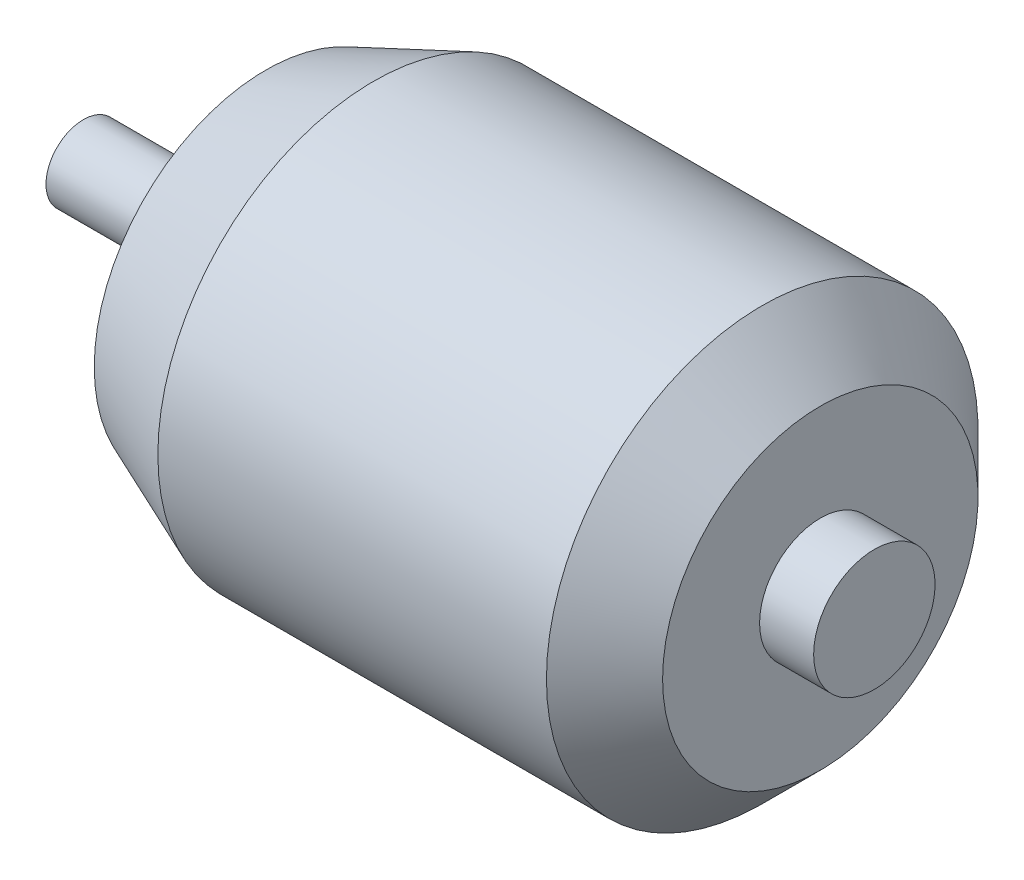
ISO-10303-21;
HEADER;
FILE_DESCRIPTION(('STEP AP214'),'2;1');
FILE_NAME('part.step','',(''),(''),'','','');
FILE_SCHEMA(('AUTOMOTIVE_DESIGN { 1 0 10303 214 1 1 1 1 }'));
ENDSEC;
DATA;
#1=APPLICATION_CONTEXT('core data for automotive mechanical design processes');
#2=APPLICATION_PROTOCOL_DEFINITION('international standard','automotive_design',2000,#1);
#3=PRODUCT_CONTEXT('',#1,'mechanical');
#4=PRODUCT('Part','Part','',(#3));
#5=PRODUCT_RELATED_PRODUCT_CATEGORY('part','',(#4));
#6=PRODUCT_DEFINITION_FORMATION('','',#4);
#7=PRODUCT_DEFINITION_CONTEXT('part definition',#1,'design');
#8=PRODUCT_DEFINITION('design','',#6,#7);
#9=PRODUCT_DEFINITION_SHAPE('','',#8);
#10=(LENGTH_UNIT() NAMED_UNIT(*) SI_UNIT(.MILLI.,.METRE.));
#11=(NAMED_UNIT(*) PLANE_ANGLE_UNIT() SI_UNIT($,.RADIAN.));
#12=(NAMED_UNIT(*) SI_UNIT($,.STERADIAN.) SOLID_ANGLE_UNIT());
#13=UNCERTAINTY_MEASURE_WITH_UNIT(LENGTH_MEASURE(1.E-05),#10,'distance_accuracy_value','');
#14=(GEOMETRIC_REPRESENTATION_CONTEXT(3) GLOBAL_UNCERTAINTY_ASSIGNED_CONTEXT((#13)) GLOBAL_UNIT_ASSIGNED_CONTEXT((#10,
#11,#12)) REPRESENTATION_CONTEXT('',''));
#15=CARTESIAN_POINT('',(0.,0.,0.));
#16=DIRECTION('',(0.,0.,1.));
#17=DIRECTION('',(1.,0.,0.));
#18=AXIS2_PLACEMENT_3D('',#15,#16,#17);
#19=CARTESIAN_POINT('',(-48.5942774192174,0.,0.));
#20=DIRECTION('',(1.,0.,0.));
#21=DIRECTION('',(0.,0.,-1.));
#22=AXIS2_PLACEMENT_3D('',#19,#20,#21);
#23=PLANE('',#22);
#24=CARTESIAN_POINT('',(-48.5942774192174,0.,0.));
#25=DIRECTION('',(-1.,0.,0.));
#26=DIRECTION('',(0.,0.,1.));
#27=AXIS2_PLACEMENT_3D('',#24,#25,#26);
#28=CIRCLE('',#27,4.29014962593515);
#29=CARTESIAN_POINT('',(-48.5942774192174,0.,4.29014962593515));
#30=VERTEX_POINT('',#29);
#31=EDGE_CURVE('E10',#30,#30,#28,.T.);
#32=ORIENTED_EDGE('',*,*,#31,.T.);
#33=EDGE_LOOP('',(#32));
#34=FACE_BOUND('',#33,.T.);
#35=ADVANCED_FACE('F34',(#34),#23,.F.);
#36=CARTESIAN_POINT('',(-68.4229426433915,0.,0.));
#37=DIRECTION('',(-1.,0.,0.));
#38=DIRECTION('',(0.,0.,1.));
#39=AXIS2_PLACEMENT_3D('',#36,#37,#38);
#40=CYLINDRICAL_SURFACE('',#39,4.29014962593515);
#41=ORIENTED_EDGE('',*,*,#31,.F.);
#42=EDGE_LOOP('',(#41));
#43=FACE_BOUND('',#42,.T.);
#44=CARTESIAN_POINT('',(-27.675590362314,0.,0.));
#45=DIRECTION('',(-1.,0.,0.));
#46=DIRECTION('',(0.,0.,1.));
#47=AXIS2_PLACEMENT_3D('',#44,#45,#46);
#48=CIRCLE('',#47,4.29014962593515);
#49=CARTESIAN_POINT('',(-27.675590362314,0.,4.29014962593515));
#50=VERTEX_POINT('',#49);
#51=EDGE_CURVE('E40',#50,#50,#48,.T.);
#52=ORIENTED_EDGE('',*,*,#51,.T.);
#53=EDGE_LOOP('',(#52));
#54=FACE_BOUND('',#53,.T.);
#55=ADVANCED_FACE('F78',(#43,#54),#40,.T.);
#56=CARTESIAN_POINT('',(-27.675590362314,4.29014962593515,0.));
#57=DIRECTION('',(1.,0.,0.));
#58=DIRECTION('',(0.,0.,-1.));
#59=AXIS2_PLACEMENT_3D('',#56,#57,#58);
#60=PLANE('',#59);
#61=ORIENTED_EDGE('',*,*,#51,.F.);
#62=EDGE_LOOP('',(#61));
#63=FACE_BOUND('',#62,.T.);
#64=CARTESIAN_POINT('',(-27.675590362314,0.,0.));
#65=DIRECTION('',(-1.,0.,0.));
#66=DIRECTION('',(0.,0.,1.));
#67=AXIS2_PLACEMENT_3D('',#64,#65,#66);
#68=CIRCLE('',#67,19.6746882793017);
#69=CARTESIAN_POINT('',(-27.675590362314,0.,19.6746882793017));
#70=VERTEX_POINT('',#69);
#71=EDGE_CURVE('E44',#70,#70,#68,.T.);
#72=ORIENTED_EDGE('',*,*,#71,.T.);
#73=EDGE_LOOP('',(#72));
#74=FACE_BOUND('',#73,.T.);
#75=ADVANCED_FACE('F82',(#63,#74),#60,.F.);
#76=CARTESIAN_POINT('',(-15.304518043112,0.,0.));
#77=DIRECTION('',(1.,0.,0.));
#78=DIRECTION('',(0.,0.,-1.));
#79=AXIS2_PLACEMENT_3D('',#76,#77,#78);
#80=CONICAL_SURFACE('',#79,24.75,0.389316721833141);
#81=ORIENTED_EDGE('',*,*,#71,.F.);
#82=EDGE_LOOP('',(#81));
#83=FACE_BOUND('',#82,.T.);
#84=CARTESIAN_POINT('',(-15.304518043112,0.,0.));
#85=DIRECTION('',(-1.,0.,0.));
#86=DIRECTION('',(0.,0.,1.));
#87=AXIS2_PLACEMENT_3D('',#84,#85,#86);
#88=CIRCLE('',#87,24.75);
#89=CARTESIAN_POINT('',(-15.304518043112,0.,24.75));
#90=VERTEX_POINT('',#89);
#91=EDGE_CURVE('E48',#90,#90,#88,.T.);
#92=ORIENTED_EDGE('',*,*,#91,.T.);
#93=EDGE_LOOP('',(#92));
#94=FACE_BOUND('',#93,.T.);
#95=ADVANCED_FACE('F87',(#83,#94),#80,.T.);
#96=CARTESIAN_POINT('',(-68.4229426433915,0.,0.));
#97=DIRECTION('',(-1.,0.,0.));
#98=DIRECTION('',(0.,0.,1.));
#99=AXIS2_PLACEMENT_3D('',#96,#97,#98);
#100=CYLINDRICAL_SURFACE('',#99,24.75);
#101=ORIENTED_EDGE('',*,*,#91,.F.);
#102=EDGE_LOOP('',(#101));
#103=FACE_BOUND('',#102,.T.);
#104=CARTESIAN_POINT('',(29.2630630042695,0.,0.));
#105=DIRECTION('',(-1.,0.,0.));
#106=DIRECTION('',(0.,0.,1.));
#107=AXIS2_PLACEMENT_3D('',#104,#105,#106);
#108=CIRCLE('',#107,24.75);
#109=CARTESIAN_POINT('',(29.2630630042695,0.,24.75));
#110=VERTEX_POINT('',#109);
#111=EDGE_CURVE('E53',#110,#110,#108,.T.);
#112=ORIENTED_EDGE('',*,*,#111,.T.);
#113=EDGE_LOOP('',(#112));
#114=FACE_BOUND('',#113,.T.);
#115=ADVANCED_FACE('F93',(#103,#114),#100,.T.);
#116=CARTESIAN_POINT('',(35.924409637686,0.,0.));
#117=DIRECTION('',(-1.,0.,0.));
#118=DIRECTION('',(0.,0.,1.));
#119=AXIS2_PLACEMENT_3D('',#116,#117,#118);
#120=CONICAL_SURFACE('',#119,18.0886533665836,0.785398163397436);
#121=ORIENTED_EDGE('',*,*,#111,.F.);
#122=EDGE_LOOP('',(#121));
#123=FACE_BOUND('',#122,.T.);
#124=CARTESIAN_POINT('',(35.924409637686,0.,0.));
#125=DIRECTION('',(-1.,0.,0.));
#126=DIRECTION('',(0.,0.,1.));
#127=AXIS2_PLACEMENT_3D('',#124,#125,#126);
#128=CIRCLE('',#127,18.0886533665836);
#129=CARTESIAN_POINT('',(35.924409637686,0.,18.0886533665836));
#130=VERTEX_POINT('',#129);
#131=EDGE_CURVE('E56',#130,#130,#128,.T.);
#132=ORIENTED_EDGE('',*,*,#131,.T.);
#133=EDGE_LOOP('',(#132));
#134=FACE_BOUND('',#133,.T.);
#135=ADVANCED_FACE('F97',(#123,#134),#120,.T.);
#136=CARTESIAN_POINT('',(35.924409637686,18.0886533665836,0.));
#137=DIRECTION('',(-1.,0.,0.));
#138=DIRECTION('',(0.,0.,1.));
#139=AXIS2_PLACEMENT_3D('',#136,#137,#138);
#140=PLANE('',#139);
#141=ORIENTED_EDGE('',*,*,#131,.F.);
#142=EDGE_LOOP('',(#141));
#143=FACE_BOUND('',#142,.T.);
#144=CARTESIAN_POINT('',(35.924409637686,0.,0.));
#145=DIRECTION('',(-1.,0.,0.));
#146=DIRECTION('',(0.,0.,1.));
#147=AXIS2_PLACEMENT_3D('',#144,#145,#146);
#148=CIRCLE('',#147,6.96232817799567);
#149=CARTESIAN_POINT('',(35.924409637686,0.,6.96232817799567));
#150=VERTEX_POINT('',#149);
#151=EDGE_CURVE('E59',#150,#150,#148,.T.);
#152=ORIENTED_EDGE('',*,*,#151,.T.);
#153=EDGE_LOOP('',(#152));
#154=FACE_BOUND('',#153,.T.);
#155=ADVANCED_FACE('F74',(#143,#154),#140,.F.);
#156=CARTESIAN_POINT('',(-68.4229426433915,0.,0.));
#157=DIRECTION('',(-1.,0.,0.));
#158=DIRECTION('',(0.,0.,1.));
#159=AXIS2_PLACEMENT_3D('',#156,#157,#158);
#160=CYLINDRICAL_SURFACE('',#159,6.96232817799567);
#161=ORIENTED_EDGE('',*,*,#151,.F.);
#162=EDGE_LOOP('',(#161));
#163=FACE_BOUND('',#162,.T.);
#164=CARTESIAN_POINT('',(42.124409637686,0.,0.));
#165=DIRECTION('',(-1.,0.,0.));
#166=DIRECTION('',(0.,0.,1.));
#167=AXIS2_PLACEMENT_3D('',#164,#165,#166);
#168=CIRCLE('',#167,6.96232817799567);
#169=CARTESIAN_POINT('',(42.124409637686,0.,6.96232817799567));
#170=VERTEX_POINT('',#169);
#171=EDGE_CURVE('E62',#170,#170,#168,.T.);
#172=ORIENTED_EDGE('',*,*,#171,.T.);
#173=EDGE_LOOP('',(#172));
#174=FACE_BOUND('',#173,.T.);
#175=ADVANCED_FACE('F66',(#163,#174),#160,.T.);
#176=CARTESIAN_POINT('',(42.124409637686,6.96232817799567,0.));
#177=DIRECTION('',(-1.,0.,0.));
#178=DIRECTION('',(0.,0.,1.));
#179=AXIS2_PLACEMENT_3D('',#176,#177,#178);
#180=PLANE('',#179);
#181=ORIENTED_EDGE('',*,*,#171,.F.);
#182=EDGE_LOOP('',(#181));
#183=FACE_BOUND('',#182,.T.);
#184=ADVANCED_FACE('F68',(#183),#180,.F.);
#185=CLOSED_SHELL('',(#35,#55,#75,#95,#115,#135,#155,#175,#184));
#186=MANIFOLD_SOLID_BREP('B2',#185);
#187=ADVANCED_BREP_SHAPE_REPRESENTATION('',(#18,#186),#14);
#188=SHAPE_DEFINITION_REPRESENTATION(#9,#187);
ENDSEC;
END-ISO-10303-21;
